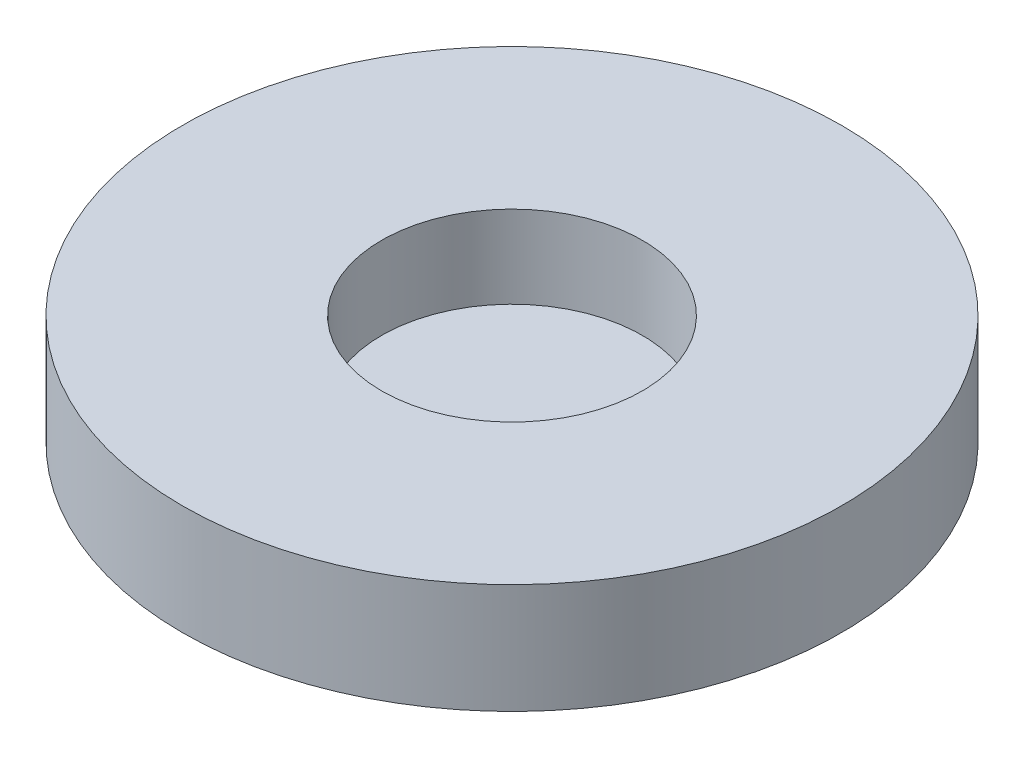
ISO-10303-21;
HEADER;
FILE_DESCRIPTION(('STEP AP214'),'2;1');
FILE_NAME('part.step','',(''),(''),'','','');
FILE_SCHEMA(('AUTOMOTIVE_DESIGN { 1 0 10303 214 1 1 1 1 }'));
ENDSEC;
DATA;
#1=APPLICATION_CONTEXT('core data for automotive mechanical design processes');
#2=APPLICATION_PROTOCOL_DEFINITION('international standard','automotive_design',2000,#1);
#3=PRODUCT_CONTEXT('',#1,'mechanical');
#4=PRODUCT('Part','Part','',(#3));
#5=PRODUCT_RELATED_PRODUCT_CATEGORY('part','',(#4));
#6=PRODUCT_DEFINITION_FORMATION('','',#4);
#7=PRODUCT_DEFINITION_CONTEXT('part definition',#1,'design');
#8=PRODUCT_DEFINITION('design','',#6,#7);
#9=PRODUCT_DEFINITION_SHAPE('','',#8);
#10=(LENGTH_UNIT() NAMED_UNIT(*) SI_UNIT(.MILLI.,.METRE.));
#11=(NAMED_UNIT(*) PLANE_ANGLE_UNIT() SI_UNIT($,.RADIAN.));
#12=(NAMED_UNIT(*) SI_UNIT($,.STERADIAN.) SOLID_ANGLE_UNIT());
#13=UNCERTAINTY_MEASURE_WITH_UNIT(LENGTH_MEASURE(1.E-05),#10,'distance_accuracy_value','');
#14=(GEOMETRIC_REPRESENTATION_CONTEXT(3) GLOBAL_UNCERTAINTY_ASSIGNED_CONTEXT((#13)) GLOBAL_UNIT_ASSIGNED_CONTEXT((#10,
#11,#12)) REPRESENTATION_CONTEXT('',''));
#15=CARTESIAN_POINT('',(0.,0.,0.));
#16=DIRECTION('',(0.,0.,1.));
#17=DIRECTION('',(1.,0.,0.));
#18=AXIS2_PLACEMENT_3D('',#15,#16,#17);
#19=CARTESIAN_POINT('',(0.,12.7,0.));
#20=DIRECTION('',(0.,-1.,0.));
#21=DIRECTION('',(0.,0.,-1.));
#22=AXIS2_PLACEMENT_3D('',#19,#20,#21);
#23=CYLINDRICAL_SURFACE('',#22,38.1);
#24=CARTESIAN_POINT('',(0.,12.7,0.));
#25=DIRECTION('',(0.,1.,0.));
#26=DIRECTION('',(0.,0.,1.));
#27=AXIS2_PLACEMENT_3D('',#24,#25,#26);
#28=CIRCLE('',#27,38.1);
#29=CARTESIAN_POINT('',(0.,12.7,38.1));
#30=VERTEX_POINT('',#29);
#31=EDGE_CURVE('E10',#30,#30,#28,.T.);
#32=ORIENTED_EDGE('',*,*,#31,.F.);
#33=EDGE_LOOP('',(#32));
#34=FACE_BOUND('',#33,.T.);
#35=CARTESIAN_POINT('',(0.,0.,0.));
#36=DIRECTION('',(0.,1.,0.));
#37=DIRECTION('',(0.,0.,1.));
#38=AXIS2_PLACEMENT_3D('',#35,#36,#37);
#39=CIRCLE('',#38,38.1);
#40=CARTESIAN_POINT('',(0.,0.,38.1));
#41=VERTEX_POINT('',#40);
#42=EDGE_CURVE('E34',#41,#41,#39,.T.);
#43=ORIENTED_EDGE('',*,*,#42,.T.);
#44=EDGE_LOOP('',(#43));
#45=FACE_BOUND('',#44,.T.);
#46=ADVANCED_FACE('F31',(#34,#45),#23,.T.);
#47=CARTESIAN_POINT('',(0.,12.7,0.));
#48=DIRECTION('',(0.,1.,0.));
#49=DIRECTION('',(0.,0.,1.));
#50=AXIS2_PLACEMENT_3D('',#47,#48,#49);
#51=PLANE('',#50);
#52=CARTESIAN_POINT('',(0.,12.7,0.));
#53=DIRECTION('',(0.,1.,0.));
#54=DIRECTION('',(0.,0.,1.));
#55=AXIS2_PLACEMENT_3D('',#52,#53,#54);
#56=CIRCLE('',#55,15.08125);
#57=CARTESIAN_POINT('',(0.,12.7,15.08125));
#58=VERTEX_POINT('',#57);
#59=EDGE_CURVE('E43',#58,#58,#56,.T.);
#60=ORIENTED_EDGE('',*,*,#59,.F.);
#61=EDGE_LOOP('',(#60));
#62=FACE_BOUND('',#61,.T.);
#63=ORIENTED_EDGE('',*,*,#31,.T.);
#64=EDGE_LOOP('',(#63));
#65=FACE_BOUND('',#64,.T.);
#66=ADVANCED_FACE('F58',(#62,#65),#51,.T.);
#67=CARTESIAN_POINT('',(0.,0.,0.));
#68=DIRECTION('',(0.,1.,0.));
#69=DIRECTION('',(0.,0.,1.));
#70=AXIS2_PLACEMENT_3D('',#67,#68,#69);
#71=PLANE('',#70);
#72=ORIENTED_EDGE('',*,*,#42,.F.);
#73=EDGE_LOOP('',(#72));
#74=FACE_BOUND('',#73,.T.);
#75=ADVANCED_FACE('F54',(#74),#71,.F.);
#76=CARTESIAN_POINT('',(0.,3.175,0.));
#77=DIRECTION('',(0.,1.,0.));
#78=DIRECTION('',(0.,0.,1.));
#79=AXIS2_PLACEMENT_3D('',#76,#77,#78);
#80=CYLINDRICAL_SURFACE('',#79,15.08125);
#81=CARTESIAN_POINT('',(0.,3.175,0.));
#82=DIRECTION('',(0.,1.,0.));
#83=DIRECTION('',(0.,0.,1.));
#84=AXIS2_PLACEMENT_3D('',#81,#82,#83);
#85=CIRCLE('',#84,15.08125);
#86=CARTESIAN_POINT('',(0.,3.175,15.08125));
#87=VERTEX_POINT('',#86);
#88=EDGE_CURVE('E41',#87,#87,#85,.T.);
#89=ORIENTED_EDGE('',*,*,#88,.F.);
#90=EDGE_LOOP('',(#89));
#91=FACE_BOUND('',#90,.T.);
#92=ORIENTED_EDGE('',*,*,#59,.T.);
#93=EDGE_LOOP('',(#92));
#94=FACE_BOUND('',#93,.T.);
#95=ADVANCED_FACE('F51',(#91,#94),#80,.F.);
#96=CARTESIAN_POINT('',(0.,3.175,0.));
#97=DIRECTION('',(0.,1.,0.));
#98=DIRECTION('',(0.,0.,1.));
#99=AXIS2_PLACEMENT_3D('',#96,#97,#98);
#100=PLANE('',#99);
#101=ORIENTED_EDGE('',*,*,#88,.T.);
#102=EDGE_LOOP('',(#101));
#103=FACE_BOUND('',#102,.T.);
#104=ADVANCED_FACE('F49',(#103),#100,.T.);
#105=CLOSED_SHELL('',(#46,#66,#75,#95,#104));
#106=MANIFOLD_SOLID_BREP('B2',#105);
#107=ADVANCED_BREP_SHAPE_REPRESENTATION('',(#18,#106),#14);
#108=SHAPE_DEFINITION_REPRESENTATION(#9,#107);
ENDSEC;
END-ISO-10303-21;
